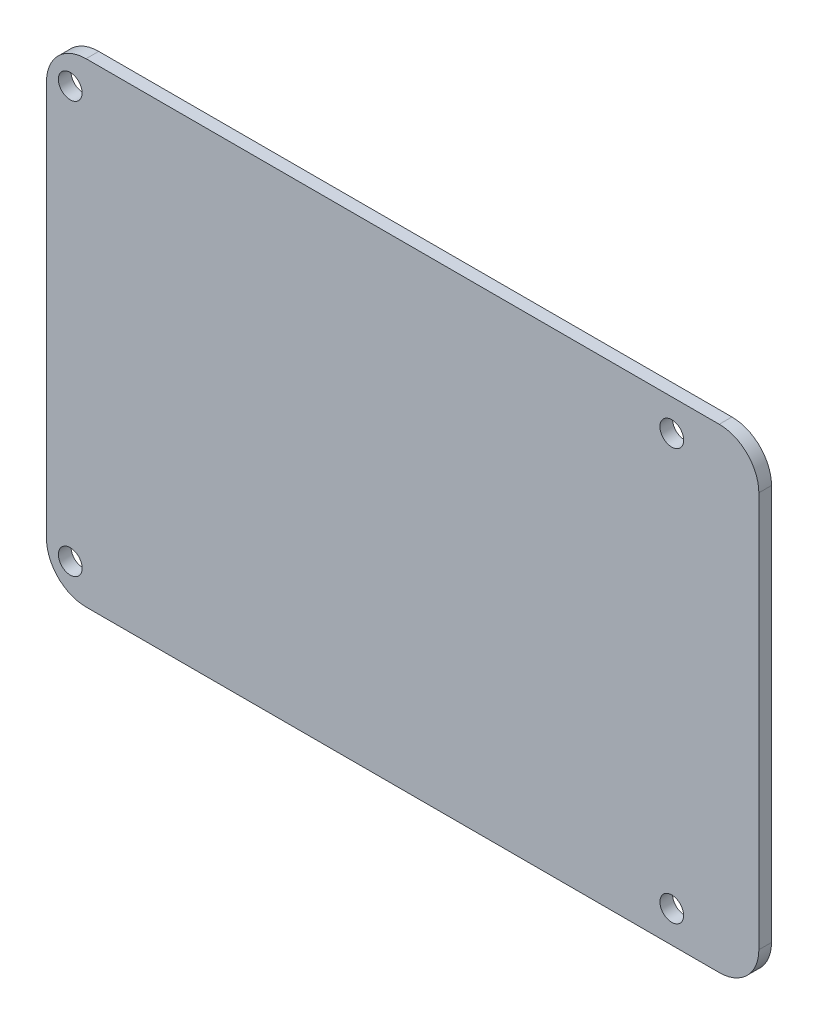
ISO-10303-21;
HEADER;
FILE_DESCRIPTION(('STEP AP214'),'2;1');
FILE_NAME('part.step','',(''),(''),'','','');
FILE_SCHEMA(('AUTOMOTIVE_DESIGN { 1 0 10303 214 1 1 1 1 }'));
ENDSEC;
DATA;
#1=APPLICATION_CONTEXT('core data for automotive mechanical design processes');
#2=APPLICATION_PROTOCOL_DEFINITION('international standard','automotive_design',2000,#1);
#3=PRODUCT_CONTEXT('',#1,'mechanical');
#4=PRODUCT('Part','Part','',(#3));
#5=PRODUCT_RELATED_PRODUCT_CATEGORY('part','',(#4));
#6=PRODUCT_DEFINITION_FORMATION('','',#4);
#7=PRODUCT_DEFINITION_CONTEXT('part definition',#1,'design');
#8=PRODUCT_DEFINITION('design','',#6,#7);
#9=PRODUCT_DEFINITION_SHAPE('','',#8);
#10=(LENGTH_UNIT() NAMED_UNIT(*) SI_UNIT(.MILLI.,.METRE.));
#11=(NAMED_UNIT(*) PLANE_ANGLE_UNIT() SI_UNIT($,.RADIAN.));
#12=(NAMED_UNIT(*) SI_UNIT($,.STERADIAN.) SOLID_ANGLE_UNIT());
#13=UNCERTAINTY_MEASURE_WITH_UNIT(LENGTH_MEASURE(1.E-05),#10,'distance_accuracy_value','');
#14=(GEOMETRIC_REPRESENTATION_CONTEXT(3) GLOBAL_UNCERTAINTY_ASSIGNED_CONTEXT((#13)) GLOBAL_UNIT_ASSIGNED_CONTEXT((#10,
#11,#12)) REPRESENTATION_CONTEXT('',''));
#15=CARTESIAN_POINT('',(0.,0.,0.));
#16=DIRECTION('',(0.,0.,1.));
#17=DIRECTION('',(1.,0.,0.));
#18=AXIS2_PLACEMENT_3D('',#15,#16,#17);
#19=CARTESIAN_POINT('',(0.,0.,1.6));
#20=DIRECTION('',(1.,0.,0.));
#21=DIRECTION('',(0.,0.,-1.));
#22=AXIS2_PLACEMENT_3D('',#19,#20,#21);
#23=PLANE('',#22);
#24=DIRECTION('',(0.,-1.,0.));
#25=VECTOR('',#24,1.);
#26=CARTESIAN_POINT('',(0.,0.,0.));
#27=LINE('',#26,#25);
#28=CARTESIAN_POINT('',(0.,55.,0.));
#29=VERTEX_POINT('',#28);
#30=CARTESIAN_POINT('',(0.,5.,0.));
#31=VERTEX_POINT('',#30);
#32=EDGE_CURVE('E130',#29,#31,#27,.T.);
#33=ORIENTED_EDGE('',*,*,#32,.T.);
#34=DIRECTION('',(0.,0.,-1.));
#35=VECTOR('',#34,1.);
#36=CARTESIAN_POINT('',(0.,5.,1.6));
#37=LINE('',#36,#35);
#38=CARTESIAN_POINT('',(0.,5.,1.6));
#39=VERTEX_POINT('',#38);
#40=EDGE_CURVE('E11',#31,#39,#37,.F.);
#41=ORIENTED_EDGE('',*,*,#40,.T.);
#42=DIRECTION('',(0.,-1.,0.));
#43=VECTOR('',#42,1.);
#44=CARTESIAN_POINT('',(0.,0.,1.6));
#45=LINE('',#44,#43);
#46=CARTESIAN_POINT('',(0.,55.,1.6));
#47=VERTEX_POINT('',#46);
#48=EDGE_CURVE('E128',#47,#39,#45,.T.);
#49=ORIENTED_EDGE('',*,*,#48,.F.);
#50=DIRECTION('',(0.,0.,-1.));
#51=VECTOR('',#50,1.);
#52=CARTESIAN_POINT('',(0.,55.,1.6));
#53=LINE('',#52,#51);
#54=EDGE_CURVE('E42',#47,#29,#53,.T.);
#55=ORIENTED_EDGE('',*,*,#54,.T.);
#56=EDGE_LOOP('',(#33,#41,#49,#55));
#57=FACE_BOUND('',#56,.T.);
#58=ADVANCED_FACE('F34',(#57),#23,.F.);
#59=CARTESIAN_POINT('',(0.,0.,1.6));
#60=DIRECTION('',(0.,1.,0.));
#61=DIRECTION('',(0.,0.,1.));
#62=AXIS2_PLACEMENT_3D('',#59,#60,#61);
#63=PLANE('',#62);
#64=DIRECTION('',(1.,0.,0.));
#65=VECTOR('',#64,1.);
#66=CARTESIAN_POINT('',(0.,0.,0.));
#67=LINE('',#66,#65);
#68=CARTESIAN_POINT('',(5.,0.,0.));
#69=VERTEX_POINT('',#68);
#70=CARTESIAN_POINT('',(85.,0.,0.));
#71=VERTEX_POINT('',#70);
#72=EDGE_CURVE('E126',#69,#71,#67,.T.);
#73=ORIENTED_EDGE('',*,*,#72,.T.);
#74=DIRECTION('',(0.,0.,-1.));
#75=VECTOR('',#74,1.);
#76=CARTESIAN_POINT('',(85.,0.,1.6));
#77=LINE('',#76,#75);
#78=CARTESIAN_POINT('',(85.,0.,1.6));
#79=VERTEX_POINT('',#78);
#80=EDGE_CURVE('E105',#71,#79,#77,.F.);
#81=ORIENTED_EDGE('',*,*,#80,.T.);
#82=DIRECTION('',(1.,0.,0.));
#83=VECTOR('',#82,1.);
#84=CARTESIAN_POINT('',(0.,0.,1.6));
#85=LINE('',#84,#83);
#86=CARTESIAN_POINT('',(5.,0.,1.6));
#87=VERTEX_POINT('',#86);
#88=EDGE_CURVE('E170',#87,#79,#85,.T.);
#89=ORIENTED_EDGE('',*,*,#88,.F.);
#90=DIRECTION('',(0.,0.,-1.));
#91=VECTOR('',#90,1.);
#92=CARTESIAN_POINT('',(5.,0.,1.6));
#93=LINE('',#92,#91);
#94=EDGE_CURVE('E110',#87,#69,#93,.T.);
#95=ORIENTED_EDGE('',*,*,#94,.T.);
#96=EDGE_LOOP('',(#73,#81,#89,#95));
#97=FACE_BOUND('',#96,.T.);
#98=ADVANCED_FACE('F210',(#97),#63,.F.);
#99=CARTESIAN_POINT('',(90.,0.,1.6));
#100=DIRECTION('',(-1.,0.,0.));
#101=DIRECTION('',(0.,-1.,0.));
#102=AXIS2_PLACEMENT_3D('',#99,#100,#101);
#103=PLANE('',#102);
#104=DIRECTION('',(0.,1.,0.));
#105=VECTOR('',#104,1.);
#106=CARTESIAN_POINT('',(90.,0.,1.6));
#107=LINE('',#106,#105);
#108=CARTESIAN_POINT('',(90.,5.,1.6));
#109=VERTEX_POINT('',#108);
#110=CARTESIAN_POINT('',(90.,55.,1.6));
#111=VERTEX_POINT('',#110);
#112=EDGE_CURVE('E119',#109,#111,#107,.T.);
#113=ORIENTED_EDGE('',*,*,#112,.F.);
#114=DIRECTION('',(0.,0.,-1.));
#115=VECTOR('',#114,1.);
#116=CARTESIAN_POINT('',(90.,5.,1.6));
#117=LINE('',#116,#115);
#118=CARTESIAN_POINT('',(90.,5.,0.));
#119=VERTEX_POINT('',#118);
#120=EDGE_CURVE('E104',#109,#119,#117,.T.);
#121=ORIENTED_EDGE('',*,*,#120,.T.);
#122=DIRECTION('',(0.,1.,0.));
#123=VECTOR('',#122,1.);
#124=CARTESIAN_POINT('',(90.,0.,0.));
#125=LINE('',#124,#123);
#126=CARTESIAN_POINT('',(90.,55.,0.));
#127=VERTEX_POINT('',#126);
#128=EDGE_CURVE('E117',#119,#127,#125,.T.);
#129=ORIENTED_EDGE('',*,*,#128,.T.);
#130=DIRECTION('',(0.,0.,-1.));
#131=VECTOR('',#130,1.);
#132=CARTESIAN_POINT('',(90.,55.,1.6));
#133=LINE('',#132,#131);
#134=EDGE_CURVE('E121',#127,#111,#133,.F.);
#135=ORIENTED_EDGE('',*,*,#134,.T.);
#136=EDGE_LOOP('',(#113,#121,#129,#135));
#137=FACE_BOUND('',#136,.T.);
#138=ADVANCED_FACE('F116',(#137),#103,.F.);
#139=CARTESIAN_POINT('',(0.,60.,1.6));
#140=DIRECTION('',(0.,-1.,0.));
#141=DIRECTION('',(0.,0.,-1.));
#142=AXIS2_PLACEMENT_3D('',#139,#140,#141);
#143=PLANE('',#142);
#144=DIRECTION('',(-1.,0.,0.));
#145=VECTOR('',#144,1.);
#146=CARTESIAN_POINT('',(0.,60.,1.6));
#147=LINE('',#146,#145);
#148=CARTESIAN_POINT('',(85.,60.,1.6));
#149=VERTEX_POINT('',#148);
#150=CARTESIAN_POINT('',(5.,60.,1.6));
#151=VERTEX_POINT('',#150);
#152=EDGE_CURVE('E134',#149,#151,#147,.T.);
#153=ORIENTED_EDGE('',*,*,#152,.F.);
#154=DIRECTION('',(0.,0.,-1.));
#155=VECTOR('',#154,1.);
#156=CARTESIAN_POINT('',(85.,60.,1.6));
#157=LINE('',#156,#155);
#158=CARTESIAN_POINT('',(85.,60.,0.));
#159=VERTEX_POINT('',#158);
#160=EDGE_CURVE('E151',#149,#159,#157,.T.);
#161=ORIENTED_EDGE('',*,*,#160,.T.);
#162=DIRECTION('',(-1.,0.,0.));
#163=VECTOR('',#162,1.);
#164=CARTESIAN_POINT('',(0.,60.,0.));
#165=LINE('',#164,#163);
#166=CARTESIAN_POINT('',(5.,60.,0.));
#167=VERTEX_POINT('',#166);
#168=EDGE_CURVE('E125',#159,#167,#165,.T.);
#169=ORIENTED_EDGE('',*,*,#168,.T.);
#170=DIRECTION('',(0.,0.,-1.));
#171=VECTOR('',#170,1.);
#172=CARTESIAN_POINT('',(5.,60.,1.6));
#173=LINE('',#172,#171);
#174=EDGE_CURVE('E49',#167,#151,#173,.F.);
#175=ORIENTED_EDGE('',*,*,#174,.T.);
#176=EDGE_LOOP('',(#153,#161,#169,#175));
#177=FACE_BOUND('',#176,.T.);
#178=ADVANCED_FACE('F235',(#177),#143,.F.);
#179=CARTESIAN_POINT('',(0.,0.,1.6));
#180=DIRECTION('',(0.,0.,-1.));
#181=DIRECTION('',(-1.,0.,0.));
#182=AXIS2_PLACEMENT_3D('',#179,#180,#181);
#183=PLANE('',#182);
#184=CARTESIAN_POINT('',(79.,4.,1.6));
#185=DIRECTION('',(0.,0.,-1.));
#186=DIRECTION('',(1.,0.,0.));
#187=AXIS2_PLACEMENT_3D('',#184,#185,#186);
#188=CIRCLE('',#187,1.5);
#189=CARTESIAN_POINT('',(80.5,4.,1.6));
#190=VERTEX_POINT('',#189);
#191=EDGE_CURVE('E186',#190,#190,#188,.T.);
#192=ORIENTED_EDGE('',*,*,#191,.T.);
#193=EDGE_LOOP('',(#192));
#194=FACE_BOUND('',#193,.T.);
#195=CARTESIAN_POINT('',(3.,4.,1.6));
#196=DIRECTION('',(0.,0.,-1.));
#197=DIRECTION('',(1.,0.,0.));
#198=AXIS2_PLACEMENT_3D('',#195,#196,#197);
#199=CIRCLE('',#198,1.5);
#200=CARTESIAN_POINT('',(4.5,4.,1.6));
#201=VERTEX_POINT('',#200);
#202=EDGE_CURVE('E187',#201,#201,#199,.T.);
#203=ORIENTED_EDGE('',*,*,#202,.T.);
#204=EDGE_LOOP('',(#203));
#205=FACE_BOUND('',#204,.T.);
#206=CARTESIAN_POINT('',(79.,56.,1.6));
#207=DIRECTION('',(0.,0.,1.));
#208=DIRECTION('',(1.,0.,0.));
#209=AXIS2_PLACEMENT_3D('',#206,#207,#208);
#210=CIRCLE('',#209,1.5);
#211=CARTESIAN_POINT('',(80.5,56.,1.6));
#212=VERTEX_POINT('',#211);
#213=EDGE_CURVE('E163',#212,#212,#210,.T.);
#214=ORIENTED_EDGE('',*,*,#213,.F.);
#215=EDGE_LOOP('',(#214));
#216=FACE_BOUND('',#215,.T.);
#217=CARTESIAN_POINT('',(3.,56.,1.6));
#218=DIRECTION('',(0.,0.,1.));
#219=DIRECTION('',(1.,0.,0.));
#220=AXIS2_PLACEMENT_3D('',#217,#218,#219);
#221=CIRCLE('',#220,1.5);
#222=CARTESIAN_POINT('',(4.5,56.,1.6));
#223=VERTEX_POINT('',#222);
#224=EDGE_CURVE('E174',#223,#223,#221,.T.);
#225=ORIENTED_EDGE('',*,*,#224,.F.);
#226=EDGE_LOOP('',(#225));
#227=FACE_BOUND('',#226,.T.);
#228=ORIENTED_EDGE('',*,*,#88,.T.);
#229=CARTESIAN_POINT('',(85.,5.,1.6));
#230=DIRECTION('',(0.,0.,-1.));
#231=DIRECTION('',(-1.,0.,0.));
#232=AXIS2_PLACEMENT_3D('',#229,#230,#231);
#233=CIRCLE('',#232,5.);
#234=EDGE_CURVE('E148',#79,#109,#233,.F.);
#235=ORIENTED_EDGE('',*,*,#234,.T.);
#236=ORIENTED_EDGE('',*,*,#112,.T.);
#237=CARTESIAN_POINT('',(85.,55.,1.6));
#238=DIRECTION('',(0.,0.,-1.));
#239=DIRECTION('',(-1.,0.,0.));
#240=AXIS2_PLACEMENT_3D('',#237,#238,#239);
#241=CIRCLE('',#240,5.);
#242=EDGE_CURVE('E56',#111,#149,#241,.F.);
#243=ORIENTED_EDGE('',*,*,#242,.T.);
#244=ORIENTED_EDGE('',*,*,#152,.T.);
#245=CARTESIAN_POINT('',(5.,55.,1.6));
#246=DIRECTION('',(0.,0.,-1.));
#247=DIRECTION('',(-1.,0.,0.));
#248=AXIS2_PLACEMENT_3D('',#245,#246,#247);
#249=CIRCLE('',#248,5.);
#250=EDGE_CURVE('E143',#151,#47,#249,.F.);
#251=ORIENTED_EDGE('',*,*,#250,.T.);
#252=ORIENTED_EDGE('',*,*,#48,.T.);
#253=CARTESIAN_POINT('',(5.,5.,1.6));
#254=DIRECTION('',(0.,0.,-1.));
#255=DIRECTION('',(-1.,0.,0.));
#256=AXIS2_PLACEMENT_3D('',#253,#254,#255);
#257=CIRCLE('',#256,5.);
#258=EDGE_CURVE('E145',#39,#87,#257,.F.);
#259=ORIENTED_EDGE('',*,*,#258,.T.);
#260=EDGE_LOOP('',(#228,#235,#236,#243,#244,#251,#252,#259));
#261=FACE_BOUND('',#260,.T.);
#262=ADVANCED_FACE('F195',(#194,#205,#216,#227,#261),#183,.F.);
#263=CARTESIAN_POINT('',(0.,0.,0.));
#264=DIRECTION('',(0.,0.,-1.));
#265=DIRECTION('',(-1.,0.,0.));
#266=AXIS2_PLACEMENT_3D('',#263,#264,#265);
#267=PLANE('',#266);
#268=CARTESIAN_POINT('',(79.,4.,0.));
#269=DIRECTION('',(0.,0.,-1.));
#270=DIRECTION('',(-1.,0.,0.));
#271=AXIS2_PLACEMENT_3D('',#268,#269,#270);
#272=CIRCLE('',#271,1.5);
#273=CARTESIAN_POINT('',(77.5,4.,0.));
#274=VERTEX_POINT('',#273);
#275=EDGE_CURVE('E178',#274,#274,#272,.T.);
#276=ORIENTED_EDGE('',*,*,#275,.F.);
#277=EDGE_LOOP('',(#276));
#278=FACE_BOUND('',#277,.T.);
#279=CARTESIAN_POINT('',(3.,4.,0.));
#280=DIRECTION('',(0.,0.,-1.));
#281=DIRECTION('',(-1.,0.,0.));
#282=AXIS2_PLACEMENT_3D('',#279,#280,#281);
#283=CIRCLE('',#282,1.5);
#284=CARTESIAN_POINT('',(1.5,4.,0.));
#285=VERTEX_POINT('',#284);
#286=EDGE_CURVE('E183',#285,#285,#283,.T.);
#287=ORIENTED_EDGE('',*,*,#286,.F.);
#288=EDGE_LOOP('',(#287));
#289=FACE_BOUND('',#288,.T.);
#290=CARTESIAN_POINT('',(79.,56.,0.));
#291=DIRECTION('',(0.,0.,-1.));
#292=DIRECTION('',(-1.,0.,0.));
#293=AXIS2_PLACEMENT_3D('',#290,#291,#292);
#294=CIRCLE('',#293,1.5);
#295=CARTESIAN_POINT('',(77.5,56.,0.));
#296=VERTEX_POINT('',#295);
#297=EDGE_CURVE('E165',#296,#296,#294,.F.);
#298=ORIENTED_EDGE('',*,*,#297,.T.);
#299=EDGE_LOOP('',(#298));
#300=FACE_BOUND('',#299,.T.);
#301=CARTESIAN_POINT('',(3.,56.,0.));
#302=DIRECTION('',(0.,0.,-1.));
#303=DIRECTION('',(-1.,0.,0.));
#304=AXIS2_PLACEMENT_3D('',#301,#302,#303);
#305=CIRCLE('',#304,1.5);
#306=CARTESIAN_POINT('',(1.5,56.,0.));
#307=VERTEX_POINT('',#306);
#308=EDGE_CURVE('E177',#307,#307,#305,.F.);
#309=ORIENTED_EDGE('',*,*,#308,.T.);
#310=EDGE_LOOP('',(#309));
#311=FACE_BOUND('',#310,.T.);
#312=ORIENTED_EDGE('',*,*,#128,.F.);
#313=CARTESIAN_POINT('',(85.,5.,0.));
#314=DIRECTION('',(0.,0.,-1.));
#315=DIRECTION('',(-1.,0.,0.));
#316=AXIS2_PLACEMENT_3D('',#313,#314,#315);
#317=CIRCLE('',#316,5.);
#318=EDGE_CURVE('E100',#119,#71,#317,.T.);
#319=ORIENTED_EDGE('',*,*,#318,.T.);
#320=ORIENTED_EDGE('',*,*,#72,.F.);
#321=CARTESIAN_POINT('',(5.,5.,0.));
#322=DIRECTION('',(0.,0.,-1.));
#323=DIRECTION('',(-1.,0.,0.));
#324=AXIS2_PLACEMENT_3D('',#321,#322,#323);
#325=CIRCLE('',#324,5.);
#326=EDGE_CURVE('E137',#69,#31,#325,.T.);
#327=ORIENTED_EDGE('',*,*,#326,.T.);
#328=ORIENTED_EDGE('',*,*,#32,.F.);
#329=CARTESIAN_POINT('',(5.,55.,0.));
#330=DIRECTION('',(0.,0.,-1.));
#331=DIRECTION('',(-1.,0.,0.));
#332=AXIS2_PLACEMENT_3D('',#329,#330,#331);
#333=CIRCLE('',#332,5.);
#334=EDGE_CURVE('E120',#29,#167,#333,.T.);
#335=ORIENTED_EDGE('',*,*,#334,.T.);
#336=ORIENTED_EDGE('',*,*,#168,.F.);
#337=CARTESIAN_POINT('',(85.,55.,0.));
#338=DIRECTION('',(0.,0.,-1.));
#339=DIRECTION('',(-1.,0.,0.));
#340=AXIS2_PLACEMENT_3D('',#337,#338,#339);
#341=CIRCLE('',#340,5.);
#342=EDGE_CURVE('E111',#159,#127,#341,.T.);
#343=ORIENTED_EDGE('',*,*,#342,.T.);
#344=EDGE_LOOP('',(#312,#319,#320,#327,#328,#335,#336,#343));
#345=FACE_BOUND('',#344,.T.);
#346=ADVANCED_FACE('F123',(#278,#289,#300,#311,#345),#267,.T.);
#347=CARTESIAN_POINT('',(85.,5.,1.6));
#348=DIRECTION('',(0.,0.,-1.));
#349=DIRECTION('',(-1.,0.,0.));
#350=AXIS2_PLACEMENT_3D('',#347,#348,#349);
#351=CYLINDRICAL_SURFACE('',#350,5.);
#352=ORIENTED_EDGE('',*,*,#234,.F.);
#353=ORIENTED_EDGE('',*,*,#80,.F.);
#354=ORIENTED_EDGE('',*,*,#318,.F.);
#355=ORIENTED_EDGE('',*,*,#120,.F.);
#356=EDGE_LOOP('',(#352,#353,#354,#355));
#357=FACE_BOUND('',#356,.T.);
#358=ADVANCED_FACE('F103',(#357),#351,.T.);
#359=CARTESIAN_POINT('',(85.,55.,1.6));
#360=DIRECTION('',(0.,0.,-1.));
#361=DIRECTION('',(-1.,0.,0.));
#362=AXIS2_PLACEMENT_3D('',#359,#360,#361);
#363=CYLINDRICAL_SURFACE('',#362,5.);
#364=ORIENTED_EDGE('',*,*,#242,.F.);
#365=ORIENTED_EDGE('',*,*,#134,.F.);
#366=ORIENTED_EDGE('',*,*,#342,.F.);
#367=ORIENTED_EDGE('',*,*,#160,.F.);
#368=EDGE_LOOP('',(#364,#365,#366,#367));
#369=FACE_BOUND('',#368,.T.);
#370=ADVANCED_FACE('F221',(#369),#363,.T.);
#371=CARTESIAN_POINT('',(5.,5.,1.6));
#372=DIRECTION('',(0.,0.,-1.));
#373=DIRECTION('',(-1.,0.,0.));
#374=AXIS2_PLACEMENT_3D('',#371,#372,#373);
#375=CYLINDRICAL_SURFACE('',#374,5.);
#376=ORIENTED_EDGE('',*,*,#258,.F.);
#377=ORIENTED_EDGE('',*,*,#40,.F.);
#378=ORIENTED_EDGE('',*,*,#326,.F.);
#379=ORIENTED_EDGE('',*,*,#94,.F.);
#380=EDGE_LOOP('',(#376,#377,#378,#379));
#381=FACE_BOUND('',#380,.T.);
#382=ADVANCED_FACE('F223',(#381),#375,.T.);
#383=CARTESIAN_POINT('',(5.,55.,1.6));
#384=DIRECTION('',(0.,0.,-1.));
#385=DIRECTION('',(-1.,0.,0.));
#386=AXIS2_PLACEMENT_3D('',#383,#384,#385);
#387=CYLINDRICAL_SURFACE('',#386,5.);
#388=ORIENTED_EDGE('',*,*,#250,.F.);
#389=ORIENTED_EDGE('',*,*,#174,.F.);
#390=ORIENTED_EDGE('',*,*,#334,.F.);
#391=ORIENTED_EDGE('',*,*,#54,.F.);
#392=EDGE_LOOP('',(#388,#389,#390,#391));
#393=FACE_BOUND('',#392,.T.);
#394=ADVANCED_FACE('F36',(#393),#387,.T.);
#395=CARTESIAN_POINT('',(3.,56.,-0.000999999999999916));
#396=DIRECTION('',(0.,0.,1.));
#397=DIRECTION('',(1.,0.,0.));
#398=AXIS2_PLACEMENT_3D('',#395,#396,#397);
#399=CYLINDRICAL_SURFACE('',#398,1.5);
#400=ORIENTED_EDGE('',*,*,#308,.F.);
#401=EDGE_LOOP('',(#400));
#402=FACE_BOUND('',#401,.T.);
#403=ORIENTED_EDGE('',*,*,#224,.T.);
#404=EDGE_LOOP('',(#403));
#405=FACE_BOUND('',#404,.T.);
#406=ADVANCED_FACE('F230',(#402,#405),#399,.F.);
#407=CARTESIAN_POINT('',(79.,56.,-0.000999999999999916));
#408=DIRECTION('',(0.,0.,1.));
#409=DIRECTION('',(1.,0.,0.));
#410=AXIS2_PLACEMENT_3D('',#407,#408,#409);
#411=CYLINDRICAL_SURFACE('',#410,1.5);
#412=ORIENTED_EDGE('',*,*,#297,.F.);
#413=EDGE_LOOP('',(#412));
#414=FACE_BOUND('',#413,.T.);
#415=ORIENTED_EDGE('',*,*,#213,.T.);
#416=EDGE_LOOP('',(#415));
#417=FACE_BOUND('',#416,.T.);
#418=ADVANCED_FACE('F206',(#414,#417),#411,.F.);
#419=CARTESIAN_POINT('',(3.,4.,-0.000999999999999916));
#420=DIRECTION('',(0.,0.,1.));
#421=DIRECTION('',(1.,0.,0.));
#422=AXIS2_PLACEMENT_3D('',#419,#420,#421);
#423=CYLINDRICAL_SURFACE('',#422,1.5);
#424=ORIENTED_EDGE('',*,*,#286,.T.);
#425=EDGE_LOOP('',(#424));
#426=FACE_BOUND('',#425,.T.);
#427=ORIENTED_EDGE('',*,*,#202,.F.);
#428=EDGE_LOOP('',(#427));
#429=FACE_BOUND('',#428,.T.);
#430=ADVANCED_FACE('F200',(#426,#429),#423,.F.);
#431=CARTESIAN_POINT('',(79.,4.,-0.000999999999999916));
#432=DIRECTION('',(0.,0.,1.));
#433=DIRECTION('',(1.,0.,0.));
#434=AXIS2_PLACEMENT_3D('',#431,#432,#433);
#435=CYLINDRICAL_SURFACE('',#434,1.5);
#436=ORIENTED_EDGE('',*,*,#275,.T.);
#437=EDGE_LOOP('',(#436));
#438=FACE_BOUND('',#437,.T.);
#439=ORIENTED_EDGE('',*,*,#191,.F.);
#440=EDGE_LOOP('',(#439));
#441=FACE_BOUND('',#440,.T.);
#442=ADVANCED_FACE('F198',(#438,#441),#435,.F.);
#443=CLOSED_SHELL('',(#58,#98,#138,#178,#262,#346,#358,#370,#382,#394,#406,#418,#430,#442));
#444=MANIFOLD_SOLID_BREP('B2',#443);
#445=ADVANCED_BREP_SHAPE_REPRESENTATION('',(#18,#444),#14);
#446=SHAPE_DEFINITION_REPRESENTATION(#9,#445);
ENDSEC;
END-ISO-10303-21;
